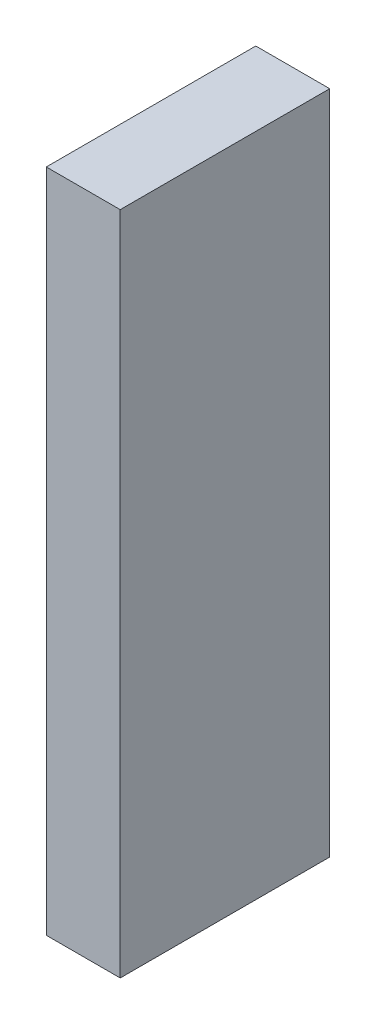
ISO-10303-21;
HEADER;
FILE_DESCRIPTION(('STEP AP214'),'2;1');
FILE_NAME('part.step','',(''),(''),'','','');
FILE_SCHEMA(('AUTOMOTIVE_DESIGN { 1 0 10303 214 1 1 1 1 }'));
ENDSEC;
DATA;
#1=APPLICATION_CONTEXT('core data for automotive mechanical design processes');
#2=APPLICATION_PROTOCOL_DEFINITION('international standard','automotive_design',2000,#1);
#3=PRODUCT_CONTEXT('',#1,'mechanical');
#4=PRODUCT('Part','Part','',(#3));
#5=PRODUCT_RELATED_PRODUCT_CATEGORY('part','',(#4));
#6=PRODUCT_DEFINITION_FORMATION('','',#4);
#7=PRODUCT_DEFINITION_CONTEXT('part definition',#1,'design');
#8=PRODUCT_DEFINITION('design','',#6,#7);
#9=PRODUCT_DEFINITION_SHAPE('','',#8);
#10=(LENGTH_UNIT() NAMED_UNIT(*) SI_UNIT(.MILLI.,.METRE.));
#11=(NAMED_UNIT(*) PLANE_ANGLE_UNIT() SI_UNIT($,.RADIAN.));
#12=(NAMED_UNIT(*) SI_UNIT($,.STERADIAN.) SOLID_ANGLE_UNIT());
#13=UNCERTAINTY_MEASURE_WITH_UNIT(LENGTH_MEASURE(1.E-05),#10,'distance_accuracy_value','');
#14=(GEOMETRIC_REPRESENTATION_CONTEXT(3) GLOBAL_UNCERTAINTY_ASSIGNED_CONTEXT((#13)) GLOBAL_UNIT_ASSIGNED_CONTEXT((#10,
#11,#12)) REPRESENTATION_CONTEXT('',''));
#15=CARTESIAN_POINT('',(0.,0.,0.));
#16=DIRECTION('',(0.,0.,1.));
#17=DIRECTION('',(1.,0.,0.));
#18=AXIS2_PLACEMENT_3D('',#15,#16,#17);
#19=CARTESIAN_POINT('',(-3.0499940983365,2.70000197766464,0.));
#20=DIRECTION('',(-1.,8.74227765734759E-08,0.));
#21=DIRECTION('',(-8.74227765734759E-08,-1.,0.));
#22=AXIS2_PLACEMENT_3D('',#19,#20,#21);
#23=PLANE('',#22);
#24=DIRECTION('',(-8.74227765512293E-08,-0.999999999999996,0.));
#25=VECTOR('',#24,1.);
#26=CARTESIAN_POINT('',(-3.0499940983365,2.70000197766464,0.));
#27=LINE('',#26,#25);
#28=CARTESIAN_POINT('',(-3.0499940983365,2.70000197766464,0.));
#29=VERTEX_POINT('',#28);
#30=CARTESIAN_POINT('',(-3.04999457041896,-2.69999191881973,0.));
#31=VERTEX_POINT('',#30);
#32=EDGE_CURVE('E11',#29,#31,#27,.T.);
#33=ORIENTED_EDGE('',*,*,#32,.T.);
#34=DIRECTION('',(0.,0.,1.));
#35=VECTOR('',#34,1.);
#36=CARTESIAN_POINT('',(-3.04999457041896,-2.69999191881973,0.));
#37=LINE('',#36,#35);
#38=CARTESIAN_POINT('',(-3.04999457041896,-2.69999191881973,1.6999990940094));
#39=VERTEX_POINT('',#38);
#40=EDGE_CURVE('E88',#31,#39,#37,.T.);
#41=ORIENTED_EDGE('',*,*,#40,.T.);
#42=DIRECTION('',(-8.74227765512293E-08,-0.999999999999996,0.));
#43=VECTOR('',#42,1.);
#44=CARTESIAN_POINT('',(-3.0499940983365,2.70000197766464,1.6999990940094));
#45=LINE('',#44,#43);
#46=CARTESIAN_POINT('',(-3.0499940983365,2.70000197766464,1.6999990940094));
#47=VERTEX_POINT('',#46);
#48=EDGE_CURVE('E83',#47,#39,#45,.T.);
#49=ORIENTED_EDGE('',*,*,#48,.F.);
#50=DIRECTION('',(0.,0.,1.));
#51=VECTOR('',#50,1.);
#52=CARTESIAN_POINT('',(-3.0499940983365,2.70000197766463,0.));
#53=LINE('',#52,#51);
#54=EDGE_CURVE('E72',#29,#47,#53,.T.);
#55=ORIENTED_EDGE('',*,*,#54,.F.);
#56=EDGE_LOOP('',(#33,#41,#49,#55));
#57=FACE_BOUND('',#56,.T.);
#58=ADVANCED_FACE('F17',(#57),#23,.T.);
#59=CARTESIAN_POINT('',(-3.04999457041896,-2.69999191881973,0.));
#60=DIRECTION('',(-8.74227765734759E-08,-1.,0.));
#61=DIRECTION('',(1.,-8.74227765734759E-08,0.));
#62=AXIS2_PLACEMENT_3D('',#59,#60,#61);
#63=PLANE('',#62);
#64=DIRECTION('',(0.999999999999996,-8.74227765127577E-08,0.));
#65=VECTOR('',#64,1.);
#66=CARTESIAN_POINT('',(-3.04999457041896,-2.69999191881973,0.));
#67=LINE('',#66,#65);
#68=CARTESIAN_POINT('',(-2.45001898448146,-2.69999197127127,0.));
#69=VERTEX_POINT('',#68);
#70=EDGE_CURVE('E24',#31,#69,#67,.T.);
#71=ORIENTED_EDGE('',*,*,#70,.T.);
#72=DIRECTION('',(0.,0.,1.));
#73=VECTOR('',#72,1.);
#74=CARTESIAN_POINT('',(-2.45001898448146,-2.69999197127127,0.));
#75=LINE('',#74,#73);
#76=CARTESIAN_POINT('',(-2.45001898448146,-2.69999197127127,1.6999990940094));
#77=VERTEX_POINT('',#76);
#78=EDGE_CURVE('E85',#69,#77,#75,.T.);
#79=ORIENTED_EDGE('',*,*,#78,.T.);
#80=DIRECTION('',(0.999999999999996,-8.74227765127577E-08,0.));
#81=VECTOR('',#80,1.);
#82=CARTESIAN_POINT('',(-3.04999457041896,-2.69999191881973,1.6999990940094));
#83=LINE('',#82,#81);
#84=EDGE_CURVE('E66',#39,#77,#83,.T.);
#85=ORIENTED_EDGE('',*,*,#84,.F.);
#86=ORIENTED_EDGE('',*,*,#40,.F.);
#87=EDGE_LOOP('',(#71,#79,#85,#86));
#88=FACE_BOUND('',#87,.T.);
#89=ADVANCED_FACE('F89',(#88),#63,.T.);
#90=CARTESIAN_POINT('',(-2.45001898448146,-2.69999197127127,0.));
#91=DIRECTION('',(1.,-8.74227765734759E-08,0.));
#92=DIRECTION('',(8.74227765734759E-08,1.,0.));
#93=AXIS2_PLACEMENT_3D('',#90,#91,#92);
#94=PLANE('',#93);
#95=DIRECTION('',(8.74227765512293E-08,0.999999999999996,0.));
#96=VECTOR('',#95,1.);
#97=CARTESIAN_POINT('',(-2.45001898448146,-2.69999197127127,0.));
#98=LINE('',#97,#96);
#99=CARTESIAN_POINT('',(-2.450018512399,2.7000019252131,0.));
#100=VERTEX_POINT('',#99);
#101=EDGE_CURVE('E62',#69,#100,#98,.T.);
#102=ORIENTED_EDGE('',*,*,#101,.T.);
#103=DIRECTION('',(0.,0.,1.));
#104=VECTOR('',#103,1.);
#105=CARTESIAN_POINT('',(-2.450018512399,2.7000019252131,0.));
#106=LINE('',#105,#104);
#107=CARTESIAN_POINT('',(-2.450018512399,2.7000019252131,1.6999990940094));
#108=VERTEX_POINT('',#107);
#109=EDGE_CURVE('E55',#100,#108,#106,.T.);
#110=ORIENTED_EDGE('',*,*,#109,.T.);
#111=DIRECTION('',(8.74227765512293E-08,0.999999999999996,0.));
#112=VECTOR('',#111,1.);
#113=CARTESIAN_POINT('',(-2.45001898448146,-2.69999197127127,1.6999990940094));
#114=LINE('',#113,#112);
#115=EDGE_CURVE('E59',#77,#108,#114,.T.);
#116=ORIENTED_EDGE('',*,*,#115,.F.);
#117=ORIENTED_EDGE('',*,*,#78,.F.);
#118=EDGE_LOOP('',(#102,#110,#116,#117));
#119=FACE_BOUND('',#118,.T.);
#120=ADVANCED_FACE('F57',(#119),#94,.T.);
#121=CARTESIAN_POINT('',(-2.450018512399,2.7000019252131,0.));
#122=DIRECTION('',(8.74227765734759E-08,1.,0.));
#123=DIRECTION('',(-1.,8.74227765734759E-08,0.));
#124=AXIS2_PLACEMENT_3D('',#121,#122,#123);
#125=PLANE('',#124);
#126=DIRECTION('',(-0.999999999999996,8.74227765127577E-08,0.));
#127=VECTOR('',#126,1.);
#128=CARTESIAN_POINT('',(-2.450018512399,2.7000019252131,0.));
#129=LINE('',#128,#127);
#130=EDGE_CURVE('E65',#100,#29,#129,.T.);
#131=ORIENTED_EDGE('',*,*,#130,.T.);
#132=ORIENTED_EDGE('',*,*,#54,.T.);
#133=DIRECTION('',(-0.999999999999996,8.74227765127577E-08,0.));
#134=VECTOR('',#133,1.);
#135=CARTESIAN_POINT('',(-2.450018512399,2.7000019252131,1.6999990940094));
#136=LINE('',#135,#134);
#137=EDGE_CURVE('E70',#108,#47,#136,.T.);
#138=ORIENTED_EDGE('',*,*,#137,.F.);
#139=ORIENTED_EDGE('',*,*,#109,.F.);
#140=EDGE_LOOP('',(#131,#132,#138,#139));
#141=FACE_BOUND('',#140,.T.);
#142=ADVANCED_FACE('F71',(#141),#125,.T.);
#143=CARTESIAN_POINT('',(141.75,74.8249893188477,1.6999990940094));
#144=DIRECTION('',(0.,0.,1.));
#145=DIRECTION('',(-1.,8.74227765734759E-08,0.));
#146=AXIS2_PLACEMENT_3D('',#143,#144,#145);
#147=PLANE('',#146);
#148=ORIENTED_EDGE('',*,*,#48,.T.);
#149=ORIENTED_EDGE('',*,*,#84,.T.);
#150=ORIENTED_EDGE('',*,*,#115,.T.);
#151=ORIENTED_EDGE('',*,*,#137,.T.);
#152=EDGE_LOOP('',(#148,#149,#150,#151));
#153=FACE_BOUND('',#152,.T.);
#154=ADVANCED_FACE('F76',(#153),#147,.T.);
#155=CARTESIAN_POINT('',(141.75,74.8249893188477,0.));
#156=DIRECTION('',(0.,0.,1.));
#157=DIRECTION('',(-1.,8.74227765734759E-08,0.));
#158=AXIS2_PLACEMENT_3D('',#155,#156,#157);
#159=PLANE('',#158);
#160=ORIENTED_EDGE('',*,*,#130,.F.);
#161=ORIENTED_EDGE('',*,*,#101,.F.);
#162=ORIENTED_EDGE('',*,*,#70,.F.);
#163=ORIENTED_EDGE('',*,*,#32,.F.);
#164=EDGE_LOOP('',(#160,#161,#162,#163));
#165=FACE_BOUND('',#164,.T.);
#166=ADVANCED_FACE('F91',(#165),#159,.F.);
#167=CLOSED_SHELL('',(#58,#89,#120,#142,#154,#166));
#168=MANIFOLD_SOLID_BREP('B1',#167);
#169=ADVANCED_BREP_SHAPE_REPRESENTATION('',(#18,#168),#14);
#170=SHAPE_DEFINITION_REPRESENTATION(#9,#169);
ENDSEC;
END-ISO-10303-21;
